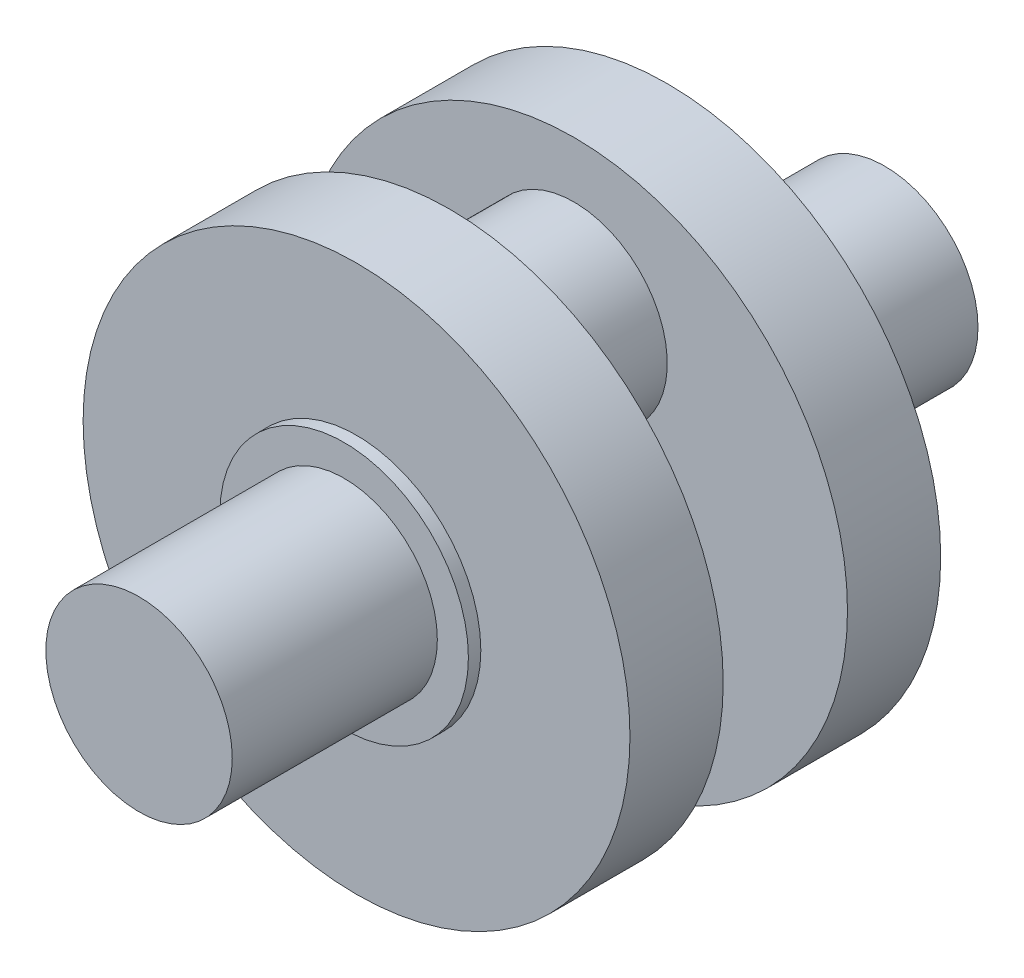
ISO-10303-21;
HEADER;
FILE_DESCRIPTION(('STEP AP214'),'2;1');
FILE_NAME('part.step','',(''),(''),'','','');
FILE_SCHEMA(('AUTOMOTIVE_DESIGN { 1 0 10303 214 1 1 1 1 }'));
ENDSEC;
DATA;
#1=APPLICATION_CONTEXT('core data for automotive mechanical design processes');
#2=APPLICATION_PROTOCOL_DEFINITION('international standard','automotive_design',2000,#1);
#3=PRODUCT_CONTEXT('',#1,'mechanical');
#4=PRODUCT('Part','Part','',(#3));
#5=PRODUCT_RELATED_PRODUCT_CATEGORY('part','',(#4));
#6=PRODUCT_DEFINITION_FORMATION('','',#4);
#7=PRODUCT_DEFINITION_CONTEXT('part definition',#1,'design');
#8=PRODUCT_DEFINITION('design','',#6,#7);
#9=PRODUCT_DEFINITION_SHAPE('','',#8);
#10=(LENGTH_UNIT() NAMED_UNIT(*) SI_UNIT(.MILLI.,.METRE.));
#11=(NAMED_UNIT(*) PLANE_ANGLE_UNIT() SI_UNIT($,.RADIAN.));
#12=(NAMED_UNIT(*) SI_UNIT($,.STERADIAN.) SOLID_ANGLE_UNIT());
#13=UNCERTAINTY_MEASURE_WITH_UNIT(LENGTH_MEASURE(1.E-05),#10,'distance_accuracy_value','');
#14=(GEOMETRIC_REPRESENTATION_CONTEXT(3) GLOBAL_UNCERTAINTY_ASSIGNED_CONTEXT((#13)) GLOBAL_UNIT_ASSIGNED_CONTEXT((#10,
#11,#12)) REPRESENTATION_CONTEXT('',''));
#15=CARTESIAN_POINT('',(0.,0.,0.));
#16=DIRECTION('',(0.,0.,1.));
#17=DIRECTION('',(1.,0.,0.));
#18=AXIS2_PLACEMENT_3D('',#15,#16,#17);
#19=CARTESIAN_POINT('',(0.,0.,33.));
#20=DIRECTION('',(0.,0.,-1.));
#21=DIRECTION('',(-1.,0.,0.));
#22=AXIS2_PLACEMENT_3D('',#19,#20,#21);
#23=CYLINDRICAL_SURFACE('',#22,15.);
#24=CARTESIAN_POINT('',(0.,0.,33.));
#25=DIRECTION('',(0.,0.,1.));
#26=DIRECTION('',(1.,0.,0.));
#27=AXIS2_PLACEMENT_3D('',#24,#25,#26);
#28=CIRCLE('',#27,15.);
#29=CARTESIAN_POINT('',(15.,0.,33.));
#30=VERTEX_POINT('',#29);
#31=EDGE_CURVE('E10',#30,#30,#28,.T.);
#32=ORIENTED_EDGE('',*,*,#31,.F.);
#33=EDGE_LOOP('',(#32));
#34=FACE_BOUND('',#33,.T.);
#35=CARTESIAN_POINT('',(0.,0.,0.));
#36=DIRECTION('',(0.,0.,1.));
#37=DIRECTION('',(1.,0.,0.));
#38=AXIS2_PLACEMENT_3D('',#35,#36,#37);
#39=CIRCLE('',#38,15.);
#40=CARTESIAN_POINT('',(15.,0.,0.));
#41=VERTEX_POINT('',#40);
#42=EDGE_CURVE('E40',#41,#41,#39,.T.);
#43=ORIENTED_EDGE('',*,*,#42,.T.);
#44=EDGE_LOOP('',(#43));
#45=FACE_BOUND('',#44,.T.);
#46=ADVANCED_FACE('F37',(#34,#45),#23,.T.);
#47=CARTESIAN_POINT('',(0.,0.,33.));
#48=DIRECTION('',(0.,0.,1.));
#49=DIRECTION('',(1.,0.,0.));
#50=AXIS2_PLACEMENT_3D('',#47,#48,#49);
#51=PLANE('',#50);
#52=ORIENTED_EDGE('',*,*,#31,.T.);
#53=EDGE_LOOP('',(#52));
#54=FACE_BOUND('',#53,.T.);
#55=ADVANCED_FACE('F120',(#54),#51,.T.);
#56=CARTESIAN_POINT('',(0.,0.,-2.));
#57=DIRECTION('',(0.,0.,1.));
#58=DIRECTION('',(1.,0.,0.));
#59=AXIS2_PLACEMENT_3D('',#56,#57,#58);
#60=CYLINDRICAL_SURFACE('',#59,20.);
#61=CARTESIAN_POINT('',(0.,0.,-2.));
#62=DIRECTION('',(0.,0.,1.));
#63=DIRECTION('',(1.,0.,0.));
#64=AXIS2_PLACEMENT_3D('',#61,#62,#63);
#65=CIRCLE('',#64,20.);
#66=CARTESIAN_POINT('',(20.,0.,-2.));
#67=VERTEX_POINT('',#66);
#68=EDGE_CURVE('E54',#67,#67,#65,.T.);
#69=ORIENTED_EDGE('',*,*,#68,.T.);
#70=EDGE_LOOP('',(#69));
#71=FACE_BOUND('',#70,.T.);
#72=CARTESIAN_POINT('',(0.,0.,0.));
#73=DIRECTION('',(0.,0.,1.));
#74=DIRECTION('',(1.,0.,0.));
#75=AXIS2_PLACEMENT_3D('',#72,#73,#74);
#76=CIRCLE('',#75,20.);
#77=CARTESIAN_POINT('',(20.,0.,0.));
#78=VERTEX_POINT('',#77);
#79=EDGE_CURVE('E49',#78,#78,#76,.T.);
#80=ORIENTED_EDGE('',*,*,#79,.F.);
#81=EDGE_LOOP('',(#80));
#82=FACE_BOUND('',#81,.T.);
#83=ADVANCED_FACE('F125',(#71,#82),#60,.T.);
#84=CARTESIAN_POINT('',(0.,0.,0.));
#85=DIRECTION('',(0.,0.,1.));
#86=DIRECTION('',(1.,0.,0.));
#87=AXIS2_PLACEMENT_3D('',#84,#85,#86);
#88=PLANE('',#87);
#89=ORIENTED_EDGE('',*,*,#42,.F.);
#90=EDGE_LOOP('',(#89));
#91=FACE_BOUND('',#90,.T.);
#92=ORIENTED_EDGE('',*,*,#79,.T.);
#93=EDGE_LOOP('',(#92));
#94=FACE_BOUND('',#93,.T.);
#95=ADVANCED_FACE('F129',(#91,#94),#88,.T.);
#96=CARTESIAN_POINT('',(0.,0.,-17.));
#97=DIRECTION('',(0.,0.,1.));
#98=DIRECTION('',(1.,0.,0.));
#99=AXIS2_PLACEMENT_3D('',#96,#97,#98);
#100=CYLINDRICAL_SURFACE('',#99,44.);
#101=CARTESIAN_POINT('',(0.,0.,-17.));
#102=DIRECTION('',(0.,0.,-1.));
#103=DIRECTION('',(-1.,0.,0.));
#104=AXIS2_PLACEMENT_3D('',#101,#102,#103);
#105=CIRCLE('',#104,44.);
#106=CARTESIAN_POINT('',(-44.,0.,-17.));
#107=VERTEX_POINT('',#106);
#108=EDGE_CURVE('E58',#107,#107,#105,.T.);
#109=ORIENTED_EDGE('',*,*,#108,.F.);
#110=EDGE_LOOP('',(#109));
#111=FACE_BOUND('',#110,.T.);
#112=CARTESIAN_POINT('',(0.,0.,-2.));
#113=DIRECTION('',(0.,0.,-1.));
#114=DIRECTION('',(-1.,0.,0.));
#115=AXIS2_PLACEMENT_3D('',#112,#113,#114);
#116=CIRCLE('',#115,44.);
#117=CARTESIAN_POINT('',(-44.,0.,-2.));
#118=VERTEX_POINT('',#117);
#119=EDGE_CURVE('E59',#118,#118,#116,.T.);
#120=ORIENTED_EDGE('',*,*,#119,.T.);
#121=EDGE_LOOP('',(#120));
#122=FACE_BOUND('',#121,.T.);
#123=ADVANCED_FACE('F132',(#111,#122),#100,.T.);
#124=CARTESIAN_POINT('',(0.,0.,-17.));
#125=DIRECTION('',(0.,0.,-1.));
#126=DIRECTION('',(-1.,0.,0.));
#127=AXIS2_PLACEMENT_3D('',#124,#125,#126);
#128=PLANE('',#127);
#129=CARTESIAN_POINT('',(0.,20.,-17.));
#130=DIRECTION('',(0.,0.,-1.));
#131=DIRECTION('',(-1.,0.,0.));
#132=AXIS2_PLACEMENT_3D('',#129,#130,#131);
#133=CIRCLE('',#132,15.);
#134=CARTESIAN_POINT('',(-15.,20.,-17.));
#135=VERTEX_POINT('',#134);
#136=EDGE_CURVE('E63',#135,#135,#133,.T.);
#137=ORIENTED_EDGE('',*,*,#136,.F.);
#138=EDGE_LOOP('',(#137));
#139=FACE_BOUND('',#138,.T.);
#140=ORIENTED_EDGE('',*,*,#108,.T.);
#141=EDGE_LOOP('',(#140));
#142=FACE_BOUND('',#141,.T.);
#143=ADVANCED_FACE('F115',(#139,#142),#128,.T.);
#144=CARTESIAN_POINT('',(0.,0.,-2.));
#145=DIRECTION('',(0.,0.,-1.));
#146=DIRECTION('',(-1.,0.,0.));
#147=AXIS2_PLACEMENT_3D('',#144,#145,#146);
#148=PLANE('',#147);
#149=ORIENTED_EDGE('',*,*,#68,.F.);
#150=EDGE_LOOP('',(#149));
#151=FACE_BOUND('',#150,.T.);
#152=ORIENTED_EDGE('',*,*,#119,.F.);
#153=EDGE_LOOP('',(#152));
#154=FACE_BOUND('',#153,.T.);
#155=ADVANCED_FACE('F105',(#151,#154),#148,.F.);
#156=CARTESIAN_POINT('',(0.,20.,-27.));
#157=DIRECTION('',(0.,0.,1.));
#158=DIRECTION('',(1.,0.,0.));
#159=AXIS2_PLACEMENT_3D('',#156,#157,#158);
#160=CYLINDRICAL_SURFACE('',#159,15.);
#161=ORIENTED_EDGE('',*,*,#136,.T.);
#162=EDGE_LOOP('',(#161));
#163=FACE_BOUND('',#162,.T.);
#164=CARTESIAN_POINT('',(0.,20.,-37.));
#165=DIRECTION('',(0.,0.,-1.));
#166=DIRECTION('',(-1.,0.,0.));
#167=AXIS2_PLACEMENT_3D('',#164,#165,#166);
#168=CIRCLE('',#167,15.);
#169=CARTESIAN_POINT('',(-15.,20.,-37.));
#170=VERTEX_POINT('',#169);
#171=EDGE_CURVE('E91',#170,#170,#168,.T.);
#172=ORIENTED_EDGE('',*,*,#171,.F.);
#173=EDGE_LOOP('',(#172));
#174=FACE_BOUND('',#173,.T.);
#175=ADVANCED_FACE('F102',(#163,#174),#160,.T.);
#176=CARTESIAN_POINT('',(0.,0.,-87.));
#177=DIRECTION('',(0.,0.,1.));
#178=DIRECTION('',(-1.,0.,0.));
#179=AXIS2_PLACEMENT_3D('',#176,#177,#178);
#180=CYLINDRICAL_SURFACE('',#179,15.);
#181=CARTESIAN_POINT('',(0.,0.,-87.));
#182=DIRECTION('',(0.,0.,1.));
#183=DIRECTION('',(1.,0.,0.));
#184=AXIS2_PLACEMENT_3D('',#181,#182,#183);
#185=CIRCLE('',#184,15.);
#186=CARTESIAN_POINT('',(15.,0.,-87.));
#187=VERTEX_POINT('',#186);
#188=EDGE_CURVE('E70',#187,#187,#185,.T.);
#189=ORIENTED_EDGE('',*,*,#188,.T.);
#190=EDGE_LOOP('',(#189));
#191=FACE_BOUND('',#190,.T.);
#192=CARTESIAN_POINT('',(0.,0.,-54.));
#193=DIRECTION('',(0.,0.,1.));
#194=DIRECTION('',(1.,0.,0.));
#195=AXIS2_PLACEMENT_3D('',#192,#193,#194);
#196=CIRCLE('',#195,15.);
#197=CARTESIAN_POINT('',(15.,0.,-54.));
#198=VERTEX_POINT('',#197);
#199=EDGE_CURVE('E71',#198,#198,#196,.T.);
#200=ORIENTED_EDGE('',*,*,#199,.F.);
#201=EDGE_LOOP('',(#200));
#202=FACE_BOUND('',#201,.T.);
#203=ADVANCED_FACE('F104',(#191,#202),#180,.T.);
#204=CARTESIAN_POINT('',(0.,0.,-87.));
#205=DIRECTION('',(0.,0.,-1.));
#206=DIRECTION('',(1.,0.,0.));
#207=AXIS2_PLACEMENT_3D('',#204,#205,#206);
#208=PLANE('',#207);
#209=ORIENTED_EDGE('',*,*,#188,.F.);
#210=EDGE_LOOP('',(#209));
#211=FACE_BOUND('',#210,.T.);
#212=ADVANCED_FACE('F112',(#211),#208,.T.);
#213=CARTESIAN_POINT('',(0.,0.,-52.));
#214=DIRECTION('',(0.,0.,-1.));
#215=DIRECTION('',(1.,0.,0.));
#216=AXIS2_PLACEMENT_3D('',#213,#214,#215);
#217=CYLINDRICAL_SURFACE('',#216,20.);
#218=CARTESIAN_POINT('',(0.,0.,-52.));
#219=DIRECTION('',(0.,0.,1.));
#220=DIRECTION('',(1.,0.,0.));
#221=AXIS2_PLACEMENT_3D('',#218,#219,#220);
#222=CIRCLE('',#221,20.);
#223=CARTESIAN_POINT('',(20.,0.,-52.));
#224=VERTEX_POINT('',#223);
#225=EDGE_CURVE('E82',#224,#224,#222,.T.);
#226=ORIENTED_EDGE('',*,*,#225,.F.);
#227=EDGE_LOOP('',(#226));
#228=FACE_BOUND('',#227,.T.);
#229=CARTESIAN_POINT('',(0.,0.,-54.));
#230=DIRECTION('',(0.,0.,1.));
#231=DIRECTION('',(1.,0.,0.));
#232=AXIS2_PLACEMENT_3D('',#229,#230,#231);
#233=CIRCLE('',#232,20.);
#234=CARTESIAN_POINT('',(20.,0.,-54.));
#235=VERTEX_POINT('',#234);
#236=EDGE_CURVE('E75',#235,#235,#233,.T.);
#237=ORIENTED_EDGE('',*,*,#236,.T.);
#238=EDGE_LOOP('',(#237));
#239=FACE_BOUND('',#238,.T.);
#240=ADVANCED_FACE('F206',(#228,#239),#217,.T.);
#241=CARTESIAN_POINT('',(0.,0.,-54.));
#242=DIRECTION('',(0.,0.,-1.));
#243=DIRECTION('',(1.,0.,0.));
#244=AXIS2_PLACEMENT_3D('',#241,#242,#243);
#245=PLANE('',#244);
#246=ORIENTED_EDGE('',*,*,#199,.T.);
#247=EDGE_LOOP('',(#246));
#248=FACE_BOUND('',#247,.T.);
#249=ORIENTED_EDGE('',*,*,#236,.F.);
#250=EDGE_LOOP('',(#249));
#251=FACE_BOUND('',#250,.T.);
#252=ADVANCED_FACE('F215',(#248,#251),#245,.T.);
#253=CARTESIAN_POINT('',(0.,0.,-37.));
#254=DIRECTION('',(0.,0.,-1.));
#255=DIRECTION('',(1.,0.,0.));
#256=AXIS2_PLACEMENT_3D('',#253,#254,#255);
#257=CYLINDRICAL_SURFACE('',#256,44.);
#258=CARTESIAN_POINT('',(0.,0.,-37.));
#259=DIRECTION('',(0.,0.,-1.));
#260=DIRECTION('',(-1.,0.,0.));
#261=AXIS2_PLACEMENT_3D('',#258,#259,#260);
#262=CIRCLE('',#261,44.);
#263=CARTESIAN_POINT('',(-44.,0.,-37.));
#264=VERTEX_POINT('',#263);
#265=EDGE_CURVE('E86',#264,#264,#262,.T.);
#266=ORIENTED_EDGE('',*,*,#265,.T.);
#267=EDGE_LOOP('',(#266));
#268=FACE_BOUND('',#267,.T.);
#269=CARTESIAN_POINT('',(0.,0.,-52.));
#270=DIRECTION('',(0.,0.,-1.));
#271=DIRECTION('',(-1.,0.,0.));
#272=AXIS2_PLACEMENT_3D('',#269,#270,#271);
#273=CIRCLE('',#272,44.);
#274=CARTESIAN_POINT('',(-44.,0.,-52.));
#275=VERTEX_POINT('',#274);
#276=EDGE_CURVE('E87',#275,#275,#273,.T.);
#277=ORIENTED_EDGE('',*,*,#276,.F.);
#278=EDGE_LOOP('',(#277));
#279=FACE_BOUND('',#278,.T.);
#280=ADVANCED_FACE('F224',(#268,#279),#257,.T.);
#281=CARTESIAN_POINT('',(0.,0.,-37.));
#282=DIRECTION('',(0.,0.,1.));
#283=DIRECTION('',(-1.,0.,0.));
#284=AXIS2_PLACEMENT_3D('',#281,#282,#283);
#285=PLANE('',#284);
#286=ORIENTED_EDGE('',*,*,#171,.T.);
#287=EDGE_LOOP('',(#286));
#288=FACE_BOUND('',#287,.T.);
#289=ORIENTED_EDGE('',*,*,#265,.F.);
#290=EDGE_LOOP('',(#289));
#291=FACE_BOUND('',#290,.T.);
#292=ADVANCED_FACE('F99',(#288,#291),#285,.T.);
#293=CARTESIAN_POINT('',(0.,0.,-52.));
#294=DIRECTION('',(0.,0.,1.));
#295=DIRECTION('',(-1.,0.,0.));
#296=AXIS2_PLACEMENT_3D('',#293,#294,#295);
#297=PLANE('',#296);
#298=ORIENTED_EDGE('',*,*,#225,.T.);
#299=EDGE_LOOP('',(#298));
#300=FACE_BOUND('',#299,.T.);
#301=ORIENTED_EDGE('',*,*,#276,.T.);
#302=EDGE_LOOP('',(#301));
#303=FACE_BOUND('',#302,.T.);
#304=ADVANCED_FACE('F241',(#300,#303),#297,.F.);
#305=CLOSED_SHELL('',(#46,#55,#83,#95,#123,#143,#155,#175,#203,#212,#240,#252,#280,#292,#304));
#306=MANIFOLD_SOLID_BREP('B2',#305);
#307=ADVANCED_BREP_SHAPE_REPRESENTATION('',(#18,#306),#14);
#308=SHAPE_DEFINITION_REPRESENTATION(#9,#307);
ENDSEC;
END-ISO-10303-21;
